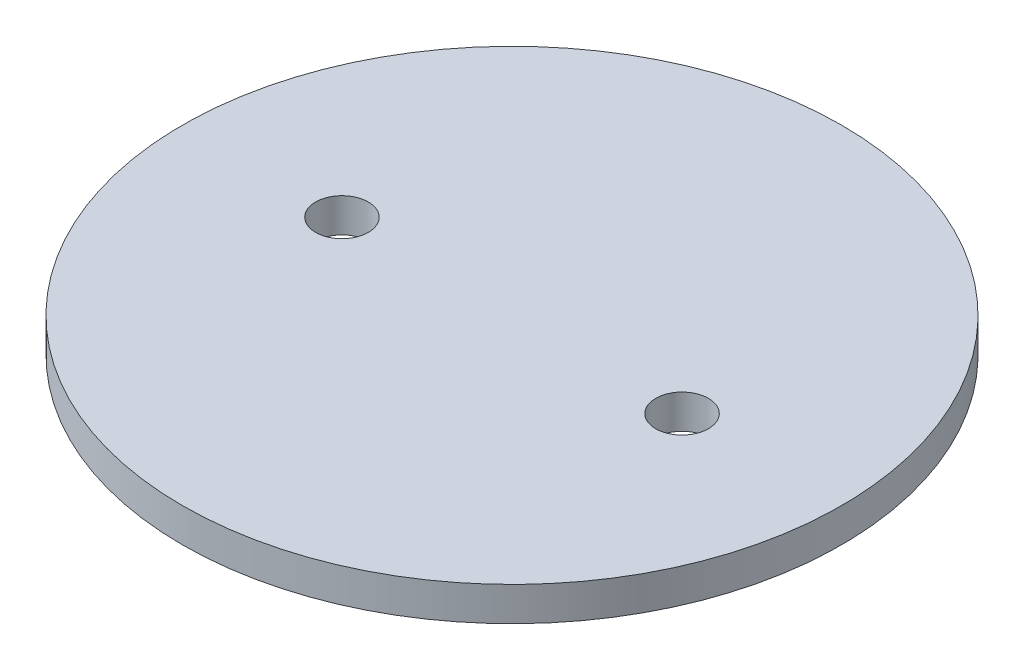
ISO-10303-21;
HEADER;
FILE_DESCRIPTION(('STEP AP214'),'2;1');
FILE_NAME('part.step','',(''),(''),'','','');
FILE_SCHEMA(('AUTOMOTIVE_DESIGN { 1 0 10303 214 1 1 1 1 }'));
ENDSEC;
DATA;
#1=APPLICATION_CONTEXT('core data for automotive mechanical design processes');
#2=APPLICATION_PROTOCOL_DEFINITION('international standard','automotive_design',2000,#1);
#3=PRODUCT_CONTEXT('',#1,'mechanical');
#4=PRODUCT('Part','Part','',(#3));
#5=PRODUCT_RELATED_PRODUCT_CATEGORY('part','',(#4));
#6=PRODUCT_DEFINITION_FORMATION('','',#4);
#7=PRODUCT_DEFINITION_CONTEXT('part definition',#1,'design');
#8=PRODUCT_DEFINITION('design','',#6,#7);
#9=PRODUCT_DEFINITION_SHAPE('','',#8);
#10=(LENGTH_UNIT() NAMED_UNIT(*) SI_UNIT(.MILLI.,.METRE.));
#11=(NAMED_UNIT(*) PLANE_ANGLE_UNIT() SI_UNIT($,.RADIAN.));
#12=(NAMED_UNIT(*) SI_UNIT($,.STERADIAN.) SOLID_ANGLE_UNIT());
#13=UNCERTAINTY_MEASURE_WITH_UNIT(LENGTH_MEASURE(1.E-05),#10,'distance_accuracy_value','');
#14=(GEOMETRIC_REPRESENTATION_CONTEXT(3) GLOBAL_UNCERTAINTY_ASSIGNED_CONTEXT((#13)) GLOBAL_UNIT_ASSIGNED_CONTEXT((#10,
#11,#12)) REPRESENTATION_CONTEXT('',''));
#15=CARTESIAN_POINT('',(0.,0.,0.));
#16=DIRECTION('',(0.,0.,1.));
#17=DIRECTION('',(1.,0.,0.));
#18=AXIS2_PLACEMENT_3D('',#15,#16,#17);
#19=CARTESIAN_POINT('',(0.,10.,0.));
#20=DIRECTION('',(0.,1.,0.));
#21=DIRECTION('',(0.,0.,1.));
#22=AXIS2_PLACEMENT_3D('',#19,#20,#21);
#23=PLANE('',#22);
#24=CARTESIAN_POINT('',(50.,10.,0.));
#25=DIRECTION('',(0.,1.,0.));
#26=DIRECTION('',(0.,0.,1.));
#27=AXIS2_PLACEMENT_3D('',#24,#25,#26);
#28=CIRCLE('',#27,7.75);
#29=CARTESIAN_POINT('',(50.,10.,7.75));
#30=VERTEX_POINT('',#29);
#31=EDGE_CURVE('E54',#30,#30,#28,.T.);
#32=ORIENTED_EDGE('',*,*,#31,.F.);
#33=EDGE_LOOP('',(#32));
#34=FACE_BOUND('',#33,.T.);
#35=CARTESIAN_POINT('',(0.,10.,0.));
#36=DIRECTION('',(0.,1.,0.));
#37=DIRECTION('',(0.,0.,1.));
#38=AXIS2_PLACEMENT_3D('',#35,#36,#37);
#39=CIRCLE('',#38,96.9);
#40=CARTESIAN_POINT('',(0.,10.,96.9));
#41=VERTEX_POINT('',#40);
#42=EDGE_CURVE('E10',#41,#41,#39,.T.);
#43=ORIENTED_EDGE('',*,*,#42,.T.);
#44=EDGE_LOOP('',(#43));
#45=FACE_BOUND('',#44,.T.);
#46=CARTESIAN_POINT('',(-50.,10.,0.));
#47=DIRECTION('',(0.,1.,0.));
#48=DIRECTION('',(0.,0.,-1.));
#49=AXIS2_PLACEMENT_3D('',#46,#47,#48);
#50=CIRCLE('',#49,7.75);
#51=CARTESIAN_POINT('',(-50.,10.,-7.75));
#52=VERTEX_POINT('',#51);
#53=EDGE_CURVE('E60',#52,#52,#50,.T.);
#54=ORIENTED_EDGE('',*,*,#53,.F.);
#55=EDGE_LOOP('',(#54));
#56=FACE_BOUND('',#55,.T.);
#57=ADVANCED_FACE('F41',(#34,#45,#56),#23,.T.);
#58=CARTESIAN_POINT('',(0.,0.,0.));
#59=DIRECTION('',(0.,1.,0.));
#60=DIRECTION('',(0.,0.,1.));
#61=AXIS2_PLACEMENT_3D('',#58,#59,#60);
#62=PLANE('',#61);
#63=CARTESIAN_POINT('',(0.,0.,0.));
#64=DIRECTION('',(0.,1.,0.));
#65=DIRECTION('',(0.,0.,1.));
#66=AXIS2_PLACEMENT_3D('',#63,#64,#65);
#67=CIRCLE('',#66,96.9);
#68=CARTESIAN_POINT('',(0.,0.,96.9));
#69=VERTEX_POINT('',#68);
#70=EDGE_CURVE('E45',#69,#69,#67,.T.);
#71=ORIENTED_EDGE('',*,*,#70,.F.);
#72=EDGE_LOOP('',(#71));
#73=FACE_BOUND('',#72,.T.);
#74=CARTESIAN_POINT('',(50.,0.,0.));
#75=DIRECTION('',(0.,1.,0.));
#76=DIRECTION('',(0.,0.,1.));
#77=AXIS2_PLACEMENT_3D('',#74,#75,#76);
#78=CIRCLE('',#77,7.75);
#79=CARTESIAN_POINT('',(50.,0.,7.75));
#80=VERTEX_POINT('',#79);
#81=EDGE_CURVE('E56',#80,#80,#78,.T.);
#82=ORIENTED_EDGE('',*,*,#81,.T.);
#83=EDGE_LOOP('',(#82));
#84=FACE_BOUND('',#83,.T.);
#85=CARTESIAN_POINT('',(-50.,0.,0.));
#86=DIRECTION('',(0.,1.,0.));
#87=DIRECTION('',(0.,0.,-1.));
#88=AXIS2_PLACEMENT_3D('',#85,#86,#87);
#89=CIRCLE('',#88,7.75);
#90=CARTESIAN_POINT('',(-50.,0.,-7.75));
#91=VERTEX_POINT('',#90);
#92=EDGE_CURVE('E64',#91,#91,#89,.T.);
#93=ORIENTED_EDGE('',*,*,#92,.T.);
#94=EDGE_LOOP('',(#93));
#95=FACE_BOUND('',#94,.T.);
#96=ADVANCED_FACE('F76',(#73,#84,#95),#62,.F.);
#97=CARTESIAN_POINT('',(0.,10.,0.));
#98=DIRECTION('',(0.,-1.,0.));
#99=DIRECTION('',(0.,0.,-1.));
#100=AXIS2_PLACEMENT_3D('',#97,#98,#99);
#101=CYLINDRICAL_SURFACE('',#100,96.9);
#102=ORIENTED_EDGE('',*,*,#42,.F.);
#103=EDGE_LOOP('',(#102));
#104=FACE_BOUND('',#103,.T.);
#105=ORIENTED_EDGE('',*,*,#70,.T.);
#106=EDGE_LOOP('',(#105));
#107=FACE_BOUND('',#106,.T.);
#108=ADVANCED_FACE('F43',(#104,#107),#101,.T.);
#109=CARTESIAN_POINT('',(50.,10.,0.));
#110=DIRECTION('',(0.,-1.,0.));
#111=DIRECTION('',(0.,0.,-1.));
#112=AXIS2_PLACEMENT_3D('',#109,#110,#111);
#113=CYLINDRICAL_SURFACE('',#112,7.75);
#114=ORIENTED_EDGE('',*,*,#31,.T.);
#115=EDGE_LOOP('',(#114));
#116=FACE_BOUND('',#115,.T.);
#117=ORIENTED_EDGE('',*,*,#81,.F.);
#118=EDGE_LOOP('',(#117));
#119=FACE_BOUND('',#118,.T.);
#120=ADVANCED_FACE('F85',(#116,#119),#113,.F.);
#121=CARTESIAN_POINT('',(-50.,10.,0.));
#122=DIRECTION('',(0.,-1.,0.));
#123=DIRECTION('',(0.,0.,-1.));
#124=AXIS2_PLACEMENT_3D('',#121,#122,#123);
#125=CYLINDRICAL_SURFACE('',#124,7.75);
#126=ORIENTED_EDGE('',*,*,#53,.T.);
#127=EDGE_LOOP('',(#126));
#128=FACE_BOUND('',#127,.T.);
#129=ORIENTED_EDGE('',*,*,#92,.F.);
#130=EDGE_LOOP('',(#129));
#131=FACE_BOUND('',#130,.T.);
#132=ADVANCED_FACE('F72',(#128,#131),#125,.F.);
#133=CLOSED_SHELL('',(#57,#96,#108,#120,#132));
#134=MANIFOLD_SOLID_BREP('B2',#133);
#135=ADVANCED_BREP_SHAPE_REPRESENTATION('',(#18,#134),#14);
#136=SHAPE_DEFINITION_REPRESENTATION(#9,#135);
ENDSEC;
END-ISO-10303-21;
